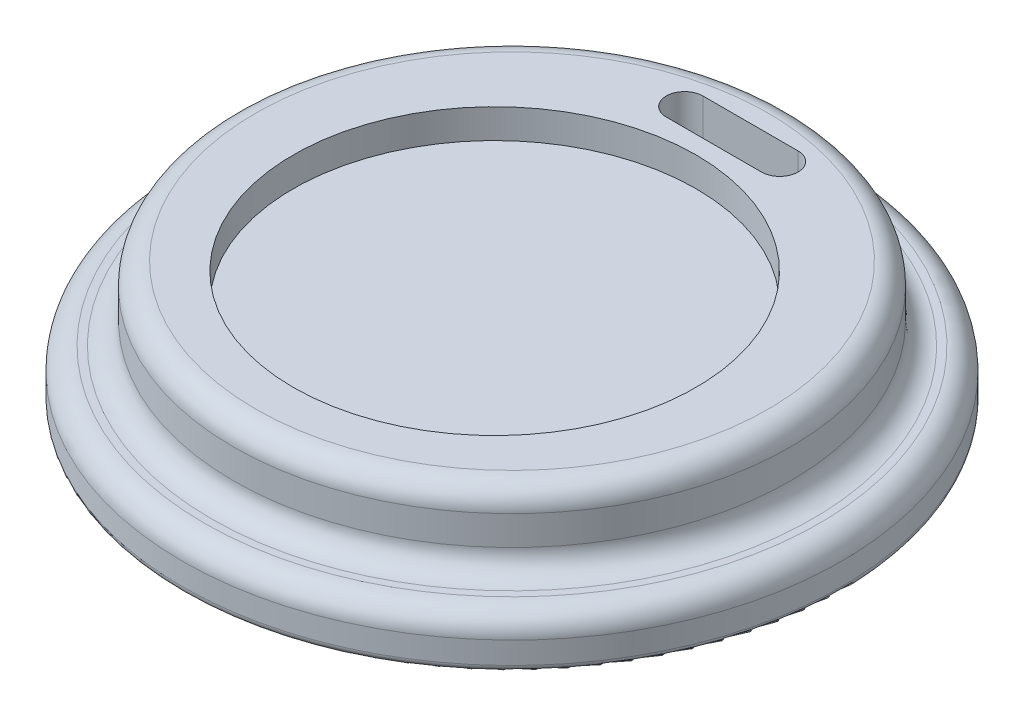
ISO-10303-21;
HEADER;
FILE_DESCRIPTION(('STEP AP214'),'2;1');
FILE_NAME('part.step','',(''),(''),'','','');
FILE_SCHEMA(('AUTOMOTIVE_DESIGN { 1 0 10303 214 1 1 1 1 }'));
ENDSEC;
DATA;
#1=APPLICATION_CONTEXT('core data for automotive mechanical design processes');
#2=APPLICATION_PROTOCOL_DEFINITION('international standard','automotive_design',2000,#1);
#3=PRODUCT_CONTEXT('',#1,'mechanical');
#4=PRODUCT('Part','Part','',(#3));
#5=PRODUCT_RELATED_PRODUCT_CATEGORY('part','',(#4));
#6=PRODUCT_DEFINITION_FORMATION('','',#4);
#7=PRODUCT_DEFINITION_CONTEXT('part definition',#1,'design');
#8=PRODUCT_DEFINITION('design','',#6,#7);
#9=PRODUCT_DEFINITION_SHAPE('','',#8);
#10=(LENGTH_UNIT() NAMED_UNIT(*) SI_UNIT(.MILLI.,.METRE.));
#11=(NAMED_UNIT(*) PLANE_ANGLE_UNIT() SI_UNIT($,.RADIAN.));
#12=(NAMED_UNIT(*) SI_UNIT($,.STERADIAN.) SOLID_ANGLE_UNIT());
#13=UNCERTAINTY_MEASURE_WITH_UNIT(LENGTH_MEASURE(1.E-05),#10,'distance_accuracy_value','');
#14=(GEOMETRIC_REPRESENTATION_CONTEXT(3) GLOBAL_UNCERTAINTY_ASSIGNED_CONTEXT((#13)) GLOBAL_UNIT_ASSIGNED_CONTEXT((#10,
#11,#12)) REPRESENTATION_CONTEXT('',''));
#15=CARTESIAN_POINT('',(0.,0.,0.));
#16=DIRECTION('',(0.,0.,1.));
#17=DIRECTION('',(1.,0.,0.));
#18=AXIS2_PLACEMENT_3D('',#15,#16,#17);
#19=CARTESIAN_POINT('',(0.,0.,0.));
#20=DIRECTION('',(0.,1.,0.));
#21=DIRECTION('',(0.,0.,1.));
#22=AXIS2_PLACEMENT_3D('',#19,#20,#21);
#23=PLANE('',#22);
#24=DIRECTION('',(-1.,0.,0.));
#25=VECTOR('',#24,1.);
#26=CARTESIAN_POINT('',(0.,0.,-32.5658546921603));
#27=LINE('',#26,#25);
#28=CARTESIAN_POINT('',(6.5,0.,-32.5658546921603));
#29=VERTEX_POINT('',#28);
#30=CARTESIAN_POINT('',(-6.5,0.,-32.5658546921603));
#31=VERTEX_POINT('',#30);
#32=EDGE_CURVE('E128',#29,#31,#27,.T.);
#33=ORIENTED_EDGE('',*,*,#32,.T.);
#34=CARTESIAN_POINT('',(-6.5,0.,-30.0658546921603));
#35=DIRECTION('',(0.,1.,0.));
#36=DIRECTION('',(0.,0.,1.));
#37=AXIS2_PLACEMENT_3D('',#34,#35,#36);
#38=CIRCLE('',#37,2.5);
#39=CARTESIAN_POINT('',(-6.5,0.,-27.5658546921603));
#40=VERTEX_POINT('',#39);
#41=EDGE_CURVE('E132',#31,#40,#38,.T.);
#42=ORIENTED_EDGE('',*,*,#41,.T.);
#43=DIRECTION('',(1.,0.,0.));
#44=VECTOR('',#43,1.);
#45=CARTESIAN_POINT('',(0.,0.,-27.5658546921603));
#46=LINE('',#45,#44);
#47=CARTESIAN_POINT('',(6.5,0.,-27.5658546921603));
#48=VERTEX_POINT('',#47);
#49=EDGE_CURVE('E119',#40,#48,#46,.T.);
#50=ORIENTED_EDGE('',*,*,#49,.T.);
#51=CARTESIAN_POINT('',(6.5,0.,-30.0658546921603));
#52=DIRECTION('',(0.,1.,0.));
#53=DIRECTION('',(0.,0.,1.));
#54=AXIS2_PLACEMENT_3D('',#51,#52,#53);
#55=CIRCLE('',#54,2.5);
#56=EDGE_CURVE('E94',#48,#29,#55,.T.);
#57=ORIENTED_EDGE('',*,*,#56,.T.);
#58=EDGE_LOOP('',(#33,#42,#50,#57));
#59=FACE_BOUND('',#58,.T.);
#60=CARTESIAN_POINT('',(0.,0.,0.));
#61=DIRECTION('',(0.,1.,0.));
#62=DIRECTION('',(0.,0.,1.));
#63=AXIS2_PLACEMENT_3D('',#60,#61,#62);
#64=CIRCLE('',#63,43.);
#65=CARTESIAN_POINT('',(0.,0.,43.));
#66=VERTEX_POINT('',#65);
#67=EDGE_CURVE('E11',#66,#66,#64,.T.);
#68=ORIENTED_EDGE('',*,*,#67,.F.);
#69=EDGE_LOOP('',(#68));
#70=FACE_BOUND('',#69,.T.);
#71=ADVANCED_FACE('F47',(#59,#70),#23,.F.);
#72=CARTESIAN_POINT('',(0.,12.,0.));
#73=DIRECTION('',(0.,1.,0.));
#74=DIRECTION('',(0.,0.,1.));
#75=AXIS2_PLACEMENT_3D('',#72,#73,#74);
#76=CYLINDRICAL_SURFACE('',#75,43.);
#77=CARTESIAN_POINT('',(0.,-5.,0.));
#78=DIRECTION('',(0.,1.,0.));
#79=DIRECTION('',(0.,0.,1.));
#80=AXIS2_PLACEMENT_3D('',#77,#78,#79);
#81=CIRCLE('',#80,43.);
#82=CARTESIAN_POINT('',(0.,-5.,43.));
#83=VERTEX_POINT('',#82);
#84=EDGE_CURVE('E55',#83,#83,#81,.T.);
#85=ORIENTED_EDGE('',*,*,#84,.F.);
#86=EDGE_LOOP('',(#85));
#87=FACE_BOUND('',#86,.T.);
#88=ORIENTED_EDGE('',*,*,#67,.T.);
#89=EDGE_LOOP('',(#88));
#90=FACE_BOUND('',#89,.T.);
#91=ADVANCED_FACE('F181',(#87,#90),#76,.F.);
#92=CARTESIAN_POINT('',(0.,-5.,-43.));
#93=DIRECTION('',(0.,1.,0.));
#94=DIRECTION('',(0.,0.,1.));
#95=AXIS2_PLACEMENT_3D('',#92,#93,#94);
#96=PLANE('',#95);
#97=CARTESIAN_POINT('',(0.,-5.,0.));
#98=DIRECTION('',(0.,1.,0.));
#99=DIRECTION('',(0.,0.,1.));
#100=AXIS2_PLACEMENT_3D('',#97,#98,#99);
#101=CIRCLE('',#100,44.);
#102=CARTESIAN_POINT('',(0.,-5.,44.));
#103=VERTEX_POINT('',#102);
#104=EDGE_CURVE('E172',#103,#103,#101,.T.);
#105=ORIENTED_EDGE('',*,*,#104,.F.);
#106=EDGE_LOOP('',(#105));
#107=FACE_BOUND('',#106,.T.);
#108=ORIENTED_EDGE('',*,*,#84,.T.);
#109=EDGE_LOOP('',(#108));
#110=FACE_BOUND('',#109,.T.);
#111=ADVANCED_FACE('F179',(#107,#110),#96,.F.);
#112=CARTESIAN_POINT('',(0.,-4.,0.));
#113=DIRECTION('',(0.,1.,0.));
#114=DIRECTION('',(0.,0.,1.));
#115=AXIS2_PLACEMENT_3D('',#112,#113,#114);
#116=TOROIDAL_SURFACE('',#115,44.,1.);
#117=CARTESIAN_POINT('',(0.,-4.,0.));
#118=DIRECTION('',(0.,1.,0.));
#119=DIRECTION('',(0.,0.,1.));
#120=AXIS2_PLACEMENT_3D('',#117,#118,#119);
#121=CIRCLE('',#120,45.);
#122=CARTESIAN_POINT('',(0.,-4.,45.));
#123=VERTEX_POINT('',#122);
#124=EDGE_CURVE('E168',#123,#123,#121,.T.);
#125=ORIENTED_EDGE('',*,*,#124,.F.);
#126=EDGE_LOOP('',(#125));
#127=FACE_BOUND('',#126,.T.);
#128=ORIENTED_EDGE('',*,*,#104,.T.);
#129=EDGE_LOOP('',(#128));
#130=FACE_BOUND('',#129,.T.);
#131=ADVANCED_FACE('F236',(#127,#130),#116,.T.);
#132=CARTESIAN_POINT('',(0.,12.,0.));
#133=DIRECTION('',(0.,1.,0.));
#134=DIRECTION('',(0.,0.,1.));
#135=AXIS2_PLACEMENT_3D('',#132,#133,#134);
#136=CYLINDRICAL_SURFACE('',#135,45.);
#137=CARTESIAN_POINT('',(0.,-1.00000000000002,0.));
#138=DIRECTION('',(0.,1.,0.));
#139=DIRECTION('',(0.,0.,1.));
#140=AXIS2_PLACEMENT_3D('',#137,#138,#139);
#141=CIRCLE('',#140,45.);
#142=CARTESIAN_POINT('',(0.,-1.00000000000002,45.));
#143=VERTEX_POINT('',#142);
#144=EDGE_CURVE('E164',#143,#143,#141,.T.);
#145=ORIENTED_EDGE('',*,*,#144,.F.);
#146=EDGE_LOOP('',(#145));
#147=FACE_BOUND('',#146,.T.);
#148=ORIENTED_EDGE('',*,*,#124,.T.);
#149=EDGE_LOOP('',(#148));
#150=FACE_BOUND('',#149,.T.);
#151=ADVANCED_FACE('F232',(#147,#150),#136,.T.);
#152=CARTESIAN_POINT('',(0.,-0.999999999999998,0.));
#153=DIRECTION('',(0.,1.,0.));
#154=DIRECTION('',(0.,0.,1.));
#155=AXIS2_PLACEMENT_3D('',#152,#153,#154);
#156=TOROIDAL_SURFACE('',#155,42.,3.);
#157=CARTESIAN_POINT('',(0.,2.,0.));
#158=DIRECTION('',(0.,1.,0.));
#159=DIRECTION('',(0.,0.,1.));
#160=AXIS2_PLACEMENT_3D('',#157,#158,#159);
#161=CIRCLE('',#160,42.);
#162=CARTESIAN_POINT('',(0.,2.,42.));
#163=VERTEX_POINT('',#162);
#164=EDGE_CURVE('E160',#163,#163,#161,.T.);
#165=ORIENTED_EDGE('',*,*,#164,.F.);
#166=EDGE_LOOP('',(#165));
#167=FACE_BOUND('',#166,.T.);
#168=ORIENTED_EDGE('',*,*,#144,.T.);
#169=EDGE_LOOP('',(#168));
#170=FACE_BOUND('',#169,.T.);
#171=ADVANCED_FACE('F228',(#167,#170),#156,.T.);
#172=CARTESIAN_POINT('',(0.,2.,-42.));
#173=DIRECTION('',(0.,-1.,0.));
#174=DIRECTION('',(0.,0.,-1.));
#175=AXIS2_PLACEMENT_3D('',#172,#173,#174);
#176=PLANE('',#175);
#177=CARTESIAN_POINT('',(0.,2.,0.));
#178=DIRECTION('',(0.,1.,0.));
#179=DIRECTION('',(0.,0.,1.));
#180=AXIS2_PLACEMENT_3D('',#177,#178,#179);
#181=CIRCLE('',#180,41.);
#182=CARTESIAN_POINT('',(0.,2.,41.));
#183=VERTEX_POINT('',#182);
#184=EDGE_CURVE('E156',#183,#183,#181,.T.);
#185=ORIENTED_EDGE('',*,*,#184,.F.);
#186=EDGE_LOOP('',(#185));
#187=FACE_BOUND('',#186,.T.);
#188=ORIENTED_EDGE('',*,*,#164,.T.);
#189=EDGE_LOOP('',(#188));
#190=FACE_BOUND('',#189,.T.);
#191=ADVANCED_FACE('F224',(#187,#190),#176,.F.);
#192=CARTESIAN_POINT('',(0.,5.,0.));
#193=DIRECTION('',(0.,1.,0.));
#194=DIRECTION('',(0.,0.,1.));
#195=AXIS2_PLACEMENT_3D('',#192,#193,#194);
#196=TOROIDAL_SURFACE('',#195,41.,3.);
#197=CARTESIAN_POINT('',(0.,5.00000000000002,0.));
#198=DIRECTION('',(0.,1.,0.));
#199=DIRECTION('',(0.,0.,1.));
#200=AXIS2_PLACEMENT_3D('',#197,#198,#199);
#201=CIRCLE('',#200,38.);
#202=CARTESIAN_POINT('',(0.,5.00000000000002,38.));
#203=VERTEX_POINT('',#202);
#204=EDGE_CURVE('E152',#203,#203,#201,.T.);
#205=ORIENTED_EDGE('',*,*,#204,.F.);
#206=EDGE_LOOP('',(#205));
#207=FACE_BOUND('',#206,.T.);
#208=ORIENTED_EDGE('',*,*,#184,.T.);
#209=EDGE_LOOP('',(#208));
#210=FACE_BOUND('',#209,.T.);
#211=ADVANCED_FACE('F220',(#207,#210),#196,.F.);
#212=CARTESIAN_POINT('',(0.,12.,0.));
#213=DIRECTION('',(0.,1.,0.));
#214=DIRECTION('',(0.,0.,1.));
#215=AXIS2_PLACEMENT_3D('',#212,#213,#214);
#216=CYLINDRICAL_SURFACE('',#215,38.);
#217=CARTESIAN_POINT('',(0.,8.99999999999998,0.));
#218=DIRECTION('',(0.,1.,0.));
#219=DIRECTION('',(0.,0.,1.));
#220=AXIS2_PLACEMENT_3D('',#217,#218,#219);
#221=CIRCLE('',#220,38.);
#222=CARTESIAN_POINT('',(0.,8.99999999999998,38.));
#223=VERTEX_POINT('',#222);
#224=EDGE_CURVE('E148',#223,#223,#221,.T.);
#225=ORIENTED_EDGE('',*,*,#224,.F.);
#226=EDGE_LOOP('',(#225));
#227=FACE_BOUND('',#226,.T.);
#228=ORIENTED_EDGE('',*,*,#204,.T.);
#229=EDGE_LOOP('',(#228));
#230=FACE_BOUND('',#229,.T.);
#231=ADVANCED_FACE('F216',(#227,#230),#216,.T.);
#232=CARTESIAN_POINT('',(0.,9.,0.));
#233=DIRECTION('',(0.,1.,0.));
#234=DIRECTION('',(0.,0.,1.));
#235=AXIS2_PLACEMENT_3D('',#232,#233,#234);
#236=TOROIDAL_SURFACE('',#235,35.,3.);
#237=CARTESIAN_POINT('',(0.,12.,0.));
#238=DIRECTION('',(0.,1.,0.));
#239=DIRECTION('',(0.,0.,1.));
#240=AXIS2_PLACEMENT_3D('',#237,#238,#239);
#241=CIRCLE('',#240,35.);
#242=CARTESIAN_POINT('',(0.,12.,35.));
#243=VERTEX_POINT('',#242);
#244=EDGE_CURVE('E141',#243,#243,#241,.T.);
#245=ORIENTED_EDGE('',*,*,#244,.F.);
#246=EDGE_LOOP('',(#245));
#247=FACE_BOUND('',#246,.T.);
#248=ORIENTED_EDGE('',*,*,#224,.T.);
#249=EDGE_LOOP('',(#248));
#250=FACE_BOUND('',#249,.T.);
#251=ADVANCED_FACE('F213',(#247,#250),#236,.T.);
#252=CARTESIAN_POINT('',(0.,12.,-35.));
#253=DIRECTION('',(0.,-1.,0.));
#254=DIRECTION('',(0.,0.,-1.));
#255=AXIS2_PLACEMENT_3D('',#252,#253,#254);
#256=PLANE('',#255);
#257=DIRECTION('',(1.,0.,0.));
#258=VECTOR('',#257,1.);
#259=CARTESIAN_POINT('',(-6.5,12.,-27.5658546921603));
#260=LINE('',#259,#258);
#261=CARTESIAN_POINT('',(-6.5,12.,-27.5658546921603));
#262=VERTEX_POINT('',#261);
#263=CARTESIAN_POINT('',(6.5,12.,-27.5658546921603));
#264=VERTEX_POINT('',#263);
#265=EDGE_CURVE('E101',#262,#264,#260,.T.);
#266=ORIENTED_EDGE('',*,*,#265,.F.);
#267=CARTESIAN_POINT('',(-6.5,12.,-30.0658546921603));
#268=DIRECTION('',(0.,1.,0.));
#269=DIRECTION('',(0.,0.,1.));
#270=AXIS2_PLACEMENT_3D('',#267,#268,#269);
#271=CIRCLE('',#270,2.5);
#272=CARTESIAN_POINT('',(-6.5,12.,-32.5658546921603));
#273=VERTEX_POINT('',#272);
#274=EDGE_CURVE('E70',#273,#262,#271,.T.);
#275=ORIENTED_EDGE('',*,*,#274,.F.);
#276=DIRECTION('',(-1.,0.,0.));
#277=VECTOR('',#276,1.);
#278=CARTESIAN_POINT('',(-6.5,12.,-32.5658546921603));
#279=LINE('',#278,#277);
#280=CARTESIAN_POINT('',(6.5,12.,-32.5658546921603));
#281=VERTEX_POINT('',#280);
#282=EDGE_CURVE('E109',#281,#273,#279,.T.);
#283=ORIENTED_EDGE('',*,*,#282,.F.);
#284=CARTESIAN_POINT('',(6.5,12.,-30.0658546921603));
#285=DIRECTION('',(0.,1.,0.));
#286=DIRECTION('',(0.,0.,1.));
#287=AXIS2_PLACEMENT_3D('',#284,#285,#286);
#288=CIRCLE('',#287,2.5);
#289=EDGE_CURVE('E91',#264,#281,#288,.T.);
#290=ORIENTED_EDGE('',*,*,#289,.F.);
#291=EDGE_LOOP('',(#266,#275,#283,#290));
#292=FACE_BOUND('',#291,.T.);
#293=CARTESIAN_POINT('',(0.,12.,2.3682906156793));
#294=DIRECTION('',(0.,1.,0.));
#295=DIRECTION('',(0.,0.,1.));
#296=AXIS2_PLACEMENT_3D('',#293,#294,#295);
#297=CIRCLE('',#296,27.5);
#298=CARTESIAN_POINT('',(0.,12.,29.8682906156793));
#299=VERTEX_POINT('',#298);
#300=EDGE_CURVE('E136',#299,#299,#297,.T.);
#301=ORIENTED_EDGE('',*,*,#300,.F.);
#302=EDGE_LOOP('',(#301));
#303=FACE_BOUND('',#302,.T.);
#304=ORIENTED_EDGE('',*,*,#244,.T.);
#305=EDGE_LOOP('',(#304));
#306=FACE_BOUND('',#305,.T.);
#307=ADVANCED_FACE('F106',(#292,#303,#306),#256,.F.);
#308=CARTESIAN_POINT('',(0.,8.,2.3682906156793));
#309=DIRECTION('',(0.,1.,0.));
#310=DIRECTION('',(0.,0.,1.));
#311=AXIS2_PLACEMENT_3D('',#308,#309,#310);
#312=CYLINDRICAL_SURFACE('',#311,27.5);
#313=CARTESIAN_POINT('',(0.,8.,2.3682906156793));
#314=DIRECTION('',(0.,1.,0.));
#315=DIRECTION('',(0.,0.,1.));
#316=AXIS2_PLACEMENT_3D('',#313,#314,#315);
#317=CIRCLE('',#316,27.5);
#318=CARTESIAN_POINT('',(0.,8.,29.8682906156793));
#319=VERTEX_POINT('',#318);
#320=EDGE_CURVE('E137',#319,#319,#317,.T.);
#321=ORIENTED_EDGE('',*,*,#320,.F.);
#322=EDGE_LOOP('',(#321));
#323=FACE_BOUND('',#322,.T.);
#324=ORIENTED_EDGE('',*,*,#300,.T.);
#325=EDGE_LOOP('',(#324));
#326=FACE_BOUND('',#325,.T.);
#327=ADVANCED_FACE('F203',(#323,#326),#312,.F.);
#328=CARTESIAN_POINT('',(0.,8.,2.3682906156793));
#329=DIRECTION('',(0.,1.,0.));
#330=DIRECTION('',(0.,0.,1.));
#331=AXIS2_PLACEMENT_3D('',#328,#329,#330);
#332=PLANE('',#331);
#333=ORIENTED_EDGE('',*,*,#320,.T.);
#334=EDGE_LOOP('',(#333));
#335=FACE_BOUND('',#334,.T.);
#336=ADVANCED_FACE('F197',(#335),#332,.T.);
#337=CARTESIAN_POINT('',(-6.5,-16.,-30.0658546921603));
#338=DIRECTION('',(0.,1.,0.));
#339=DIRECTION('',(0.,0.,1.));
#340=AXIS2_PLACEMENT_3D('',#337,#338,#339);
#341=CYLINDRICAL_SURFACE('',#340,2.5);
#342=DIRECTION('',(0.,1.,0.));
#343=VECTOR('',#342,1.);
#344=CARTESIAN_POINT('',(-6.5,-16.,-32.5658546921603));
#345=LINE('',#344,#343);
#346=EDGE_CURVE('E116',#31,#273,#345,.T.);
#347=ORIENTED_EDGE('',*,*,#346,.T.);
#348=ORIENTED_EDGE('',*,*,#274,.T.);
#349=DIRECTION('',(0.,1.,0.));
#350=VECTOR('',#349,1.);
#351=CARTESIAN_POINT('',(-6.5,-16.,-27.5658546921603));
#352=LINE('',#351,#350);
#353=EDGE_CURVE('E98',#40,#262,#352,.T.);
#354=ORIENTED_EDGE('',*,*,#353,.F.);
#355=ORIENTED_EDGE('',*,*,#41,.F.);
#356=EDGE_LOOP('',(#347,#348,#354,#355));
#357=FACE_BOUND('',#356,.T.);
#358=ADVANCED_FACE('F195',(#357),#341,.F.);
#359=CARTESIAN_POINT('',(-6.5,-16.,-32.5658546921603));
#360=DIRECTION('',(0.,0.,-1.));
#361=DIRECTION('',(-1.,0.,0.));
#362=AXIS2_PLACEMENT_3D('',#359,#360,#361);
#363=PLANE('',#362);
#364=DIRECTION('',(0.,1.,0.));
#365=VECTOR('',#364,1.);
#366=CARTESIAN_POINT('',(6.5,-16.,-32.5658546921603));
#367=LINE('',#366,#365);
#368=EDGE_CURVE('E97',#29,#281,#367,.T.);
#369=ORIENTED_EDGE('',*,*,#368,.T.);
#370=ORIENTED_EDGE('',*,*,#282,.T.);
#371=ORIENTED_EDGE('',*,*,#346,.F.);
#372=ORIENTED_EDGE('',*,*,#32,.F.);
#373=EDGE_LOOP('',(#369,#370,#371,#372));
#374=FACE_BOUND('',#373,.T.);
#375=ADVANCED_FACE('F194',(#374),#363,.F.);
#376=CARTESIAN_POINT('',(6.5,-16.,-30.0658546921603));
#377=DIRECTION('',(0.,1.,0.));
#378=DIRECTION('',(0.,0.,1.));
#379=AXIS2_PLACEMENT_3D('',#376,#377,#378);
#380=CYLINDRICAL_SURFACE('',#379,2.5);
#381=DIRECTION('',(0.,1.,0.));
#382=VECTOR('',#381,1.);
#383=CARTESIAN_POINT('',(6.5,-16.,-27.5658546921603));
#384=LINE('',#383,#382);
#385=EDGE_CURVE('E62',#48,#264,#384,.T.);
#386=ORIENTED_EDGE('',*,*,#385,.T.);
#387=ORIENTED_EDGE('',*,*,#289,.T.);
#388=ORIENTED_EDGE('',*,*,#368,.F.);
#389=ORIENTED_EDGE('',*,*,#56,.F.);
#390=EDGE_LOOP('',(#386,#387,#388,#389));
#391=FACE_BOUND('',#390,.T.);
#392=ADVANCED_FACE('F88',(#391),#380,.F.);
#393=CARTESIAN_POINT('',(-6.5,-16.,-27.5658546921603));
#394=DIRECTION('',(0.,0.,1.));
#395=DIRECTION('',(1.,0.,0.));
#396=AXIS2_PLACEMENT_3D('',#393,#394,#395);
#397=PLANE('',#396);
#398=ORIENTED_EDGE('',*,*,#353,.T.);
#399=ORIENTED_EDGE('',*,*,#265,.T.);
#400=ORIENTED_EDGE('',*,*,#385,.F.);
#401=ORIENTED_EDGE('',*,*,#49,.F.);
#402=EDGE_LOOP('',(#398,#399,#400,#401));
#403=FACE_BOUND('',#402,.T.);
#404=ADVANCED_FACE('F102',(#403),#397,.F.);
#405=CLOSED_SHELL('',(#71,#91,#111,#131,#151,#171,#191,#211,#231,#251,#307,#327,#336,#358,#375,
#392,#404));
#406=MANIFOLD_SOLID_BREP('B2',#405);
#407=ADVANCED_BREP_SHAPE_REPRESENTATION('',(#18,#406),#14);
#408=SHAPE_DEFINITION_REPRESENTATION(#9,#407);
ENDSEC;
END-ISO-10303-21;
